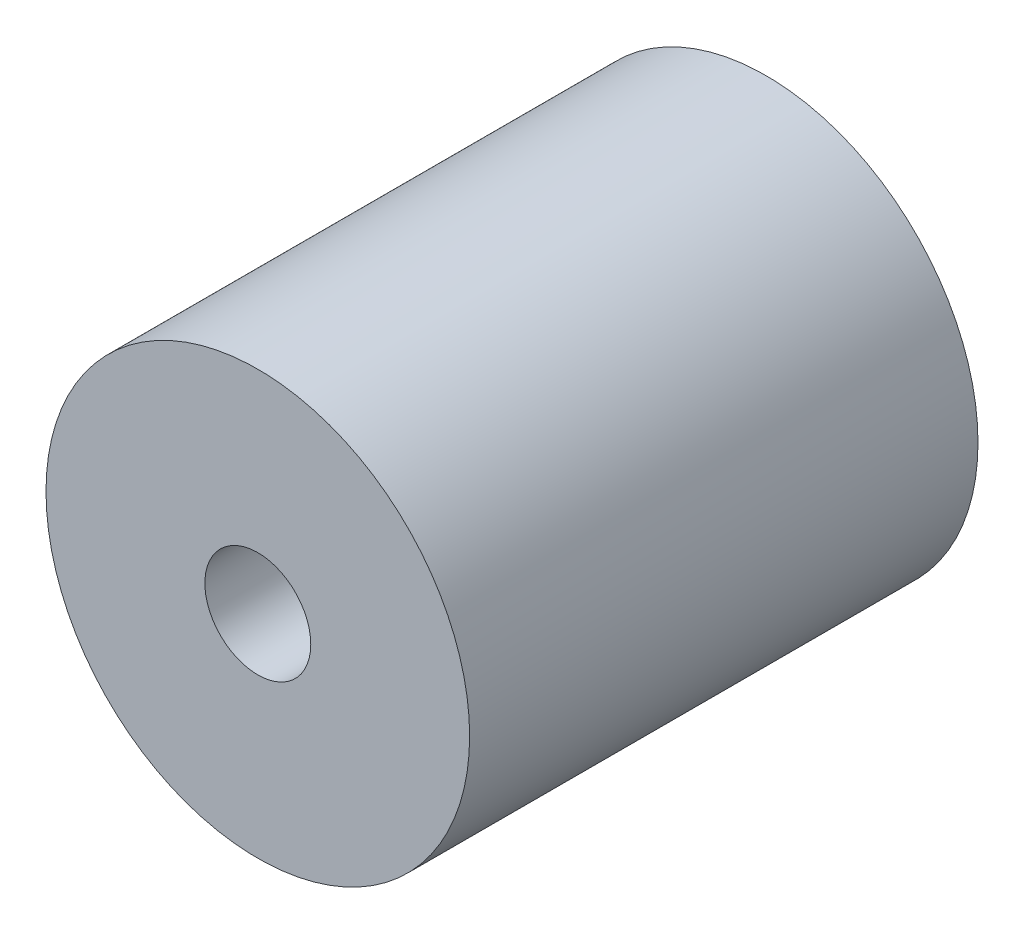
ISO-10303-21;
HEADER;
FILE_DESCRIPTION(('STEP AP214'),'2;1');
FILE_NAME('part.step','',(''),(''),'','','');
FILE_SCHEMA(('AUTOMOTIVE_DESIGN { 1 0 10303 214 1 1 1 1 }'));
ENDSEC;
DATA;
#1=APPLICATION_CONTEXT('core data for automotive mechanical design processes');
#2=APPLICATION_PROTOCOL_DEFINITION('international standard','automotive_design',2000,#1);
#3=PRODUCT_CONTEXT('',#1,'mechanical');
#4=PRODUCT('Part','Part','',(#3));
#5=PRODUCT_RELATED_PRODUCT_CATEGORY('part','',(#4));
#6=PRODUCT_DEFINITION_FORMATION('','',#4);
#7=PRODUCT_DEFINITION_CONTEXT('part definition',#1,'design');
#8=PRODUCT_DEFINITION('design','',#6,#7);
#9=PRODUCT_DEFINITION_SHAPE('','',#8);
#10=(LENGTH_UNIT() NAMED_UNIT(*) SI_UNIT(.MILLI.,.METRE.));
#11=(NAMED_UNIT(*) PLANE_ANGLE_UNIT() SI_UNIT($,.RADIAN.));
#12=(NAMED_UNIT(*) SI_UNIT($,.STERADIAN.) SOLID_ANGLE_UNIT());
#13=UNCERTAINTY_MEASURE_WITH_UNIT(LENGTH_MEASURE(1.E-05),#10,'distance_accuracy_value','');
#14=(GEOMETRIC_REPRESENTATION_CONTEXT(3) GLOBAL_UNCERTAINTY_ASSIGNED_CONTEXT((#13)) GLOBAL_UNIT_ASSIGNED_CONTEXT((#10,
#11,#12)) REPRESENTATION_CONTEXT('',''));
#15=CARTESIAN_POINT('',(0.,0.,0.));
#16=DIRECTION('',(0.,0.,1.));
#17=DIRECTION('',(1.,0.,0.));
#18=AXIS2_PLACEMENT_3D('',#15,#16,#17);
#19=CARTESIAN_POINT('',(0.,0.,24.));
#20=DIRECTION('',(0.,0.,-1.));
#21=DIRECTION('',(-1.,0.,0.));
#22=AXIS2_PLACEMENT_3D('',#19,#20,#21);
#23=CYLINDRICAL_SURFACE('',#22,10.);
#24=CARTESIAN_POINT('',(0.,0.,24.));
#25=DIRECTION('',(0.,0.,1.));
#26=DIRECTION('',(1.,0.,0.));
#27=AXIS2_PLACEMENT_3D('',#24,#25,#26);
#28=CIRCLE('',#27,10.);
#29=CARTESIAN_POINT('',(10.,0.,24.));
#30=VERTEX_POINT('',#29);
#31=EDGE_CURVE('E10',#30,#30,#28,.T.);
#32=ORIENTED_EDGE('',*,*,#31,.F.);
#33=EDGE_LOOP('',(#32));
#34=FACE_BOUND('',#33,.T.);
#35=CARTESIAN_POINT('',(0.,0.,0.));
#36=DIRECTION('',(0.,0.,1.));
#37=DIRECTION('',(1.,0.,0.));
#38=AXIS2_PLACEMENT_3D('',#35,#36,#37);
#39=CIRCLE('',#38,10.);
#40=CARTESIAN_POINT('',(10.,0.,0.));
#41=VERTEX_POINT('',#40);
#42=EDGE_CURVE('E35',#41,#41,#39,.T.);
#43=ORIENTED_EDGE('',*,*,#42,.T.);
#44=EDGE_LOOP('',(#43));
#45=FACE_BOUND('',#44,.T.);
#46=ADVANCED_FACE('F32',(#34,#45),#23,.T.);
#47=CARTESIAN_POINT('',(0.,0.,24.));
#48=DIRECTION('',(0.,0.,1.));
#49=DIRECTION('',(1.,0.,0.));
#50=AXIS2_PLACEMENT_3D('',#47,#48,#49);
#51=PLANE('',#50);
#52=CARTESIAN_POINT('',(0.,0.,24.));
#53=DIRECTION('',(0.,0.,1.));
#54=DIRECTION('',(1.,0.,0.));
#55=AXIS2_PLACEMENT_3D('',#52,#53,#54);
#56=CIRCLE('',#55,2.5);
#57=CARTESIAN_POINT('',(2.5,0.,24.));
#58=VERTEX_POINT('',#57);
#59=EDGE_CURVE('E42',#58,#58,#56,.T.);
#60=ORIENTED_EDGE('',*,*,#59,.F.);
#61=EDGE_LOOP('',(#60));
#62=FACE_BOUND('',#61,.T.);
#63=ORIENTED_EDGE('',*,*,#31,.T.);
#64=EDGE_LOOP('',(#63));
#65=FACE_BOUND('',#64,.T.);
#66=ADVANCED_FACE('F69',(#62,#65),#51,.T.);
#67=CARTESIAN_POINT('',(0.,0.,0.));
#68=DIRECTION('',(0.,0.,1.));
#69=DIRECTION('',(1.,0.,0.));
#70=AXIS2_PLACEMENT_3D('',#67,#68,#69);
#71=PLANE('',#70);
#72=CARTESIAN_POINT('',(0.,0.,0.));
#73=DIRECTION('',(0.,0.,-1.));
#74=DIRECTION('',(-1.,0.,0.));
#75=AXIS2_PLACEMENT_3D('',#72,#73,#74);
#76=CIRCLE('',#75,4.);
#77=CARTESIAN_POINT('',(-4.,0.,0.));
#78=VERTEX_POINT('',#77);
#79=EDGE_CURVE('E50',#78,#78,#76,.T.);
#80=ORIENTED_EDGE('',*,*,#79,.F.);
#81=EDGE_LOOP('',(#80));
#82=FACE_BOUND('',#81,.T.);
#83=ORIENTED_EDGE('',*,*,#42,.F.);
#84=EDGE_LOOP('',(#83));
#85=FACE_BOUND('',#84,.T.);
#86=ADVANCED_FACE('F65',(#82,#85),#71,.F.);
#87=CARTESIAN_POINT('',(0.,0.,12.));
#88=DIRECTION('',(0.,0.,1.));
#89=DIRECTION('',(1.,0.,0.));
#90=AXIS2_PLACEMENT_3D('',#87,#88,#89);
#91=CYLINDRICAL_SURFACE('',#90,2.5);
#92=CARTESIAN_POINT('',(0.,0.,12.));
#93=DIRECTION('',(0.,0.,1.));
#94=DIRECTION('',(1.,0.,0.));
#95=AXIS2_PLACEMENT_3D('',#92,#93,#94);
#96=CIRCLE('',#95,2.5);
#97=CARTESIAN_POINT('',(2.5,0.,12.));
#98=VERTEX_POINT('',#97);
#99=EDGE_CURVE('E46',#98,#98,#96,.T.);
#100=ORIENTED_EDGE('',*,*,#99,.F.);
#101=EDGE_LOOP('',(#100));
#102=FACE_BOUND('',#101,.T.);
#103=ORIENTED_EDGE('',*,*,#59,.T.);
#104=EDGE_LOOP('',(#103));
#105=FACE_BOUND('',#104,.T.);
#106=ADVANCED_FACE('F68',(#102,#105),#91,.F.);
#107=CARTESIAN_POINT('',(0.,0.,12.));
#108=DIRECTION('',(0.,0.,-1.));
#109=DIRECTION('',(-1.,0.,0.));
#110=AXIS2_PLACEMENT_3D('',#107,#108,#109);
#111=PLANE('',#110);
#112=CARTESIAN_POINT('',(0.,0.,12.));
#113=DIRECTION('',(0.,0.,-1.));
#114=DIRECTION('',(-1.,0.,0.));
#115=AXIS2_PLACEMENT_3D('',#112,#113,#114);
#116=CIRCLE('',#115,4.);
#117=CARTESIAN_POINT('',(-4.,0.,12.));
#118=VERTEX_POINT('',#117);
#119=EDGE_CURVE('E49',#118,#118,#116,.T.);
#120=ORIENTED_EDGE('',*,*,#119,.T.);
#121=EDGE_LOOP('',(#120));
#122=FACE_BOUND('',#121,.T.);
#123=ORIENTED_EDGE('',*,*,#99,.T.);
#124=EDGE_LOOP('',(#123));
#125=FACE_BOUND('',#124,.T.);
#126=ADVANCED_FACE('F56',(#122,#125),#111,.T.);
#127=CARTESIAN_POINT('',(0.,0.,12.));
#128=DIRECTION('',(0.,0.,-1.));
#129=DIRECTION('',(-1.,0.,0.));
#130=AXIS2_PLACEMENT_3D('',#127,#128,#129);
#131=CYLINDRICAL_SURFACE('',#130,4.);
#132=ORIENTED_EDGE('',*,*,#119,.F.);
#133=EDGE_LOOP('',(#132));
#134=FACE_BOUND('',#133,.T.);
#135=ORIENTED_EDGE('',*,*,#79,.T.);
#136=EDGE_LOOP('',(#135));
#137=FACE_BOUND('',#136,.T.);
#138=ADVANCED_FACE('F59',(#134,#137),#131,.F.);
#139=CLOSED_SHELL('',(#46,#66,#86,#106,#126,#138));
#140=MANIFOLD_SOLID_BREP('B2',#139);
#141=ADVANCED_BREP_SHAPE_REPRESENTATION('',(#18,#140),#14);
#142=SHAPE_DEFINITION_REPRESENTATION(#9,#141);
ENDSEC;
END-ISO-10303-21;
